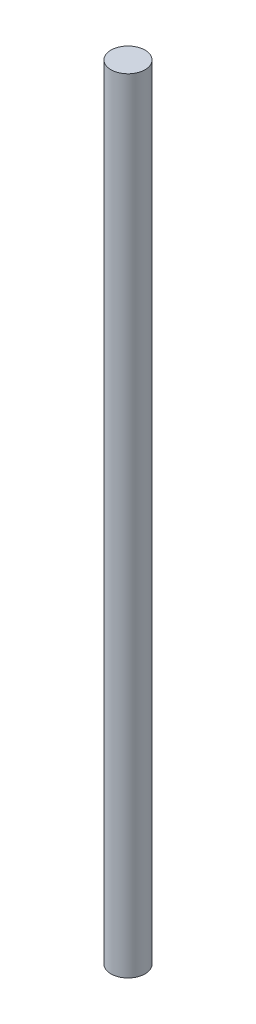
ISO-10303-21;
HEADER;
FILE_DESCRIPTION(('STEP AP214'),'2;1');
FILE_NAME('part.step','',(''),(''),'','','');
FILE_SCHEMA(('AUTOMOTIVE_DESIGN { 1 0 10303 214 1 1 1 1 }'));
ENDSEC;
DATA;
#1=APPLICATION_CONTEXT('core data for automotive mechanical design processes');
#2=APPLICATION_PROTOCOL_DEFINITION('international standard','automotive_design',2000,#1);
#3=PRODUCT_CONTEXT('',#1,'mechanical');
#4=PRODUCT('Part','Part','',(#3));
#5=PRODUCT_RELATED_PRODUCT_CATEGORY('part','',(#4));
#6=PRODUCT_DEFINITION_FORMATION('','',#4);
#7=PRODUCT_DEFINITION_CONTEXT('part definition',#1,'design');
#8=PRODUCT_DEFINITION('design','',#6,#7);
#9=PRODUCT_DEFINITION_SHAPE('','',#8);
#10=(LENGTH_UNIT() NAMED_UNIT(*) SI_UNIT(.MILLI.,.METRE.));
#11=(NAMED_UNIT(*) PLANE_ANGLE_UNIT() SI_UNIT($,.RADIAN.));
#12=(NAMED_UNIT(*) SI_UNIT($,.STERADIAN.) SOLID_ANGLE_UNIT());
#13=UNCERTAINTY_MEASURE_WITH_UNIT(LENGTH_MEASURE(1.E-05),#10,'distance_accuracy_value','');
#14=(GEOMETRIC_REPRESENTATION_CONTEXT(3) GLOBAL_UNCERTAINTY_ASSIGNED_CONTEXT((#13)) GLOBAL_UNIT_ASSIGNED_CONTEXT((#10,
#11,#12)) REPRESENTATION_CONTEXT('',''));
#15=CARTESIAN_POINT('',(0.,0.,0.));
#16=DIRECTION('',(0.,0.,1.));
#17=DIRECTION('',(1.,0.,0.));
#18=AXIS2_PLACEMENT_3D('',#15,#16,#17);
#19=CARTESIAN_POINT('',(0.,584.2,0.));
#20=DIRECTION('',(0.,-1.,0.));
#21=DIRECTION('',(0.,0.,-1.));
#22=AXIS2_PLACEMENT_3D('',#19,#20,#21);
#23=CYLINDRICAL_SURFACE('',#22,12.7);
#24=CARTESIAN_POINT('',(0.,584.2,0.));
#25=DIRECTION('',(0.,1.,0.));
#26=DIRECTION('',(0.,0.,1.));
#27=AXIS2_PLACEMENT_3D('',#24,#25,#26);
#28=CIRCLE('',#27,12.7);
#29=CARTESIAN_POINT('',(0.,584.2,12.7));
#30=VERTEX_POINT('',#29);
#31=EDGE_CURVE('E10',#30,#30,#28,.T.);
#32=ORIENTED_EDGE('',*,*,#31,.F.);
#33=EDGE_LOOP('',(#32));
#34=FACE_BOUND('',#33,.T.);
#35=CARTESIAN_POINT('',(0.,0.,0.));
#36=DIRECTION('',(0.,1.,0.));
#37=DIRECTION('',(0.,0.,1.));
#38=AXIS2_PLACEMENT_3D('',#35,#36,#37);
#39=CIRCLE('',#38,12.7);
#40=CARTESIAN_POINT('',(0.,0.,12.7));
#41=VERTEX_POINT('',#40);
#42=EDGE_CURVE('E38',#41,#41,#39,.T.);
#43=ORIENTED_EDGE('',*,*,#42,.T.);
#44=EDGE_LOOP('',(#43));
#45=FACE_BOUND('',#44,.T.);
#46=ADVANCED_FACE('F35',(#34,#45),#23,.T.);
#47=CARTESIAN_POINT('',(0.,584.2,0.));
#48=DIRECTION('',(0.,1.,0.));
#49=DIRECTION('',(0.,0.,1.));
#50=AXIS2_PLACEMENT_3D('',#47,#48,#49);
#51=PLANE('',#50);
#52=ORIENTED_EDGE('',*,*,#31,.T.);
#53=EDGE_LOOP('',(#52));
#54=FACE_BOUND('',#53,.T.);
#55=ADVANCED_FACE('F50',(#54),#51,.T.);
#56=CARTESIAN_POINT('',(0.,0.,0.));
#57=DIRECTION('',(0.,1.,0.));
#58=DIRECTION('',(0.,0.,1.));
#59=AXIS2_PLACEMENT_3D('',#56,#57,#58);
#60=PLANE('',#59);
#61=ORIENTED_EDGE('',*,*,#42,.F.);
#62=EDGE_LOOP('',(#61));
#63=FACE_BOUND('',#62,.T.);
#64=ADVANCED_FACE('F48',(#63),#60,.F.);
#65=CLOSED_SHELL('',(#46,#55,#64));
#66=MANIFOLD_SOLID_BREP('B2',#65);
#67=ADVANCED_BREP_SHAPE_REPRESENTATION('',(#18,#66),#14);
#68=SHAPE_DEFINITION_REPRESENTATION(#9,#67);
ENDSEC;
END-ISO-10303-21;
